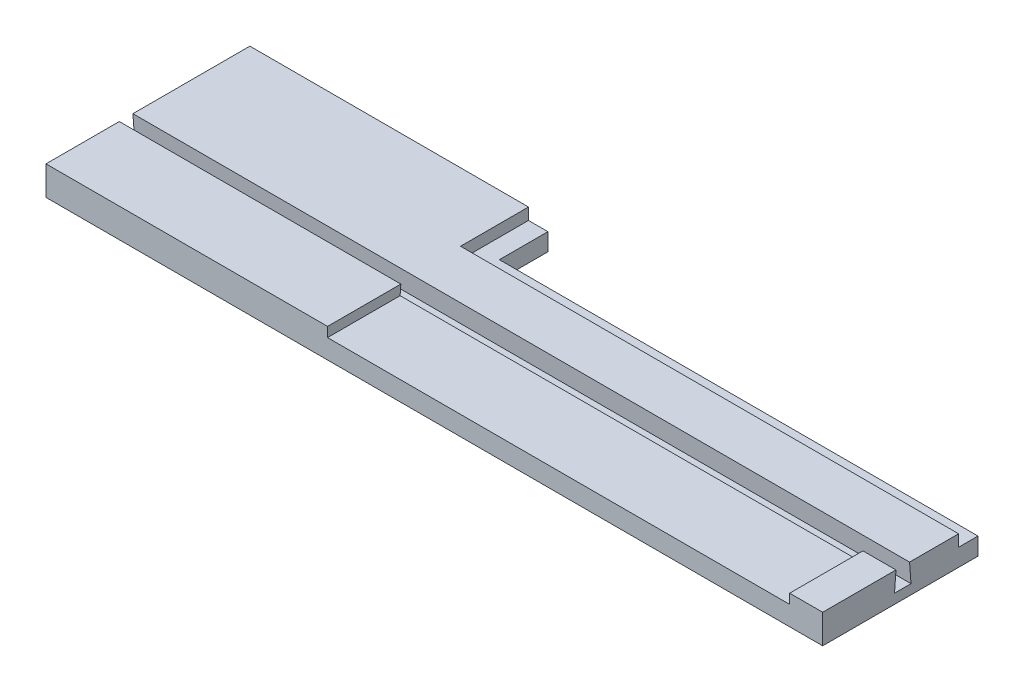
ISO-10303-21;
HEADER;
FILE_DESCRIPTION(('STEP AP214'),'2;1');
FILE_NAME('part.step','',(''),(''),'','','');
FILE_SCHEMA(('AUTOMOTIVE_DESIGN { 1 0 10303 214 1 1 1 1 }'));
ENDSEC;
DATA;
#1=APPLICATION_CONTEXT('core data for automotive mechanical design processes');
#2=APPLICATION_PROTOCOL_DEFINITION('international standard','automotive_design',2000,#1);
#3=PRODUCT_CONTEXT('',#1,'mechanical');
#4=PRODUCT('Part','Part','',(#3));
#5=PRODUCT_RELATED_PRODUCT_CATEGORY('part','',(#4));
#6=PRODUCT_DEFINITION_FORMATION('','',#4);
#7=PRODUCT_DEFINITION_CONTEXT('part definition',#1,'design');
#8=PRODUCT_DEFINITION('design','',#6,#7);
#9=PRODUCT_DEFINITION_SHAPE('','',#8);
#10=(LENGTH_UNIT() NAMED_UNIT(*) SI_UNIT(.MILLI.,.METRE.));
#11=(NAMED_UNIT(*) PLANE_ANGLE_UNIT() SI_UNIT($,.RADIAN.));
#12=(NAMED_UNIT(*) SI_UNIT($,.STERADIAN.) SOLID_ANGLE_UNIT());
#13=UNCERTAINTY_MEASURE_WITH_UNIT(LENGTH_MEASURE(1.E-05),#10,'distance_accuracy_value','');
#14=(GEOMETRIC_REPRESENTATION_CONTEXT(3) GLOBAL_UNCERTAINTY_ASSIGNED_CONTEXT((#13)) GLOBAL_UNIT_ASSIGNED_CONTEXT((#10,
#11,#12)) REPRESENTATION_CONTEXT('',''));
#15=CARTESIAN_POINT('',(0.,0.,0.));
#16=DIRECTION('',(0.,0.,1.));
#17=DIRECTION('',(1.,0.,0.));
#18=AXIS2_PLACEMENT_3D('',#15,#16,#17);
#19=CARTESIAN_POINT('',(0.,4.,0.));
#20=DIRECTION('',(0.,-1.,0.));
#21=DIRECTION('',(0.,0.,-1.));
#22=AXIS2_PLACEMENT_3D('',#19,#20,#21);
#23=PLANE('',#22);
#24=DIRECTION('',(-1.,0.,0.));
#25=VECTOR('',#24,1.);
#26=CARTESIAN_POINT('',(74.4601625665586,4.,-2.68636363636364));
#27=LINE('',#26,#25);
#28=CARTESIAN_POINT('',(72.4545454545455,4.,-2.68636363636364));
#29=VERTEX_POINT('',#28);
#30=CARTESIAN_POINT('',(69.0545454545454,4.,-2.68636363636364));
#31=VERTEX_POINT('',#30);
#32=EDGE_CURVE('E251',#29,#31,#27,.T.);
#33=ORIENTED_EDGE('',*,*,#32,.T.);
#34=DIRECTION('',(0.,0.,-1.));
#35=VECTOR('',#34,1.);
#36=CARTESIAN_POINT('',(69.0545454545454,4.,4.86363636363636));
#37=LINE('',#36,#35);
#38=CARTESIAN_POINT('',(69.0545454545454,4.,4.86363636363636));
#39=VERTEX_POINT('',#38);
#40=EDGE_CURVE('E185',#39,#31,#37,.T.);
#41=ORIENTED_EDGE('',*,*,#40,.F.);
#42=DIRECTION('',(1.,0.,0.));
#43=VECTOR('',#42,1.);
#44=CARTESIAN_POINT('',(-7.54545454545454,4.,4.86363636363636));
#45=LINE('',#44,#43);
#46=CARTESIAN_POINT('',(72.4545454545454,4.,4.86363636363636));
#47=VERTEX_POINT('',#46);
#48=EDGE_CURVE('E309',#39,#47,#45,.T.);
#49=ORIENTED_EDGE('',*,*,#48,.T.);
#50=DIRECTION('',(0.,0.,-1.));
#51=VECTOR('',#50,1.);
#52=CARTESIAN_POINT('',(72.4545454545454,4.,4.86363636363636));
#53=LINE('',#52,#51);
#54=EDGE_CURVE('E306',#47,#29,#53,.T.);
#55=ORIENTED_EDGE('',*,*,#54,.T.);
#56=EDGE_LOOP('',(#33,#41,#49,#55));
#57=FACE_BOUND('',#56,.T.);
#58=ADVANCED_FACE('F39',(#57),#23,.F.);
#59=CARTESIAN_POINT('',(-7.54545454545454,2.,-9.13636363636364));
#60=DIRECTION('',(0.,0.,1.));
#61=DIRECTION('',(1.,0.,0.));
#62=AXIS2_PLACEMENT_3D('',#59,#60,#61);
#63=PLANE('',#62);
#64=DIRECTION('',(-1.,0.,0.));
#65=VECTOR('',#64,1.);
#66=CARTESIAN_POINT('',(21.1545454545455,2.8,-9.13636363636364));
#67=LINE('',#66,#65);
#68=CARTESIAN_POINT('',(72.4545454545455,2.8,-9.13636363636364));
#69=VERTEX_POINT('',#68);
#70=CARTESIAN_POINT('',(21.1545454545455,2.8,-9.13636363636364));
#71=VERTEX_POINT('',#70);
#72=EDGE_CURVE('E213',#69,#71,#67,.T.);
#73=ORIENTED_EDGE('',*,*,#72,.T.);
#74=DIRECTION('',(0.,-1.,0.));
#75=VECTOR('',#74,1.);
#76=CARTESIAN_POINT('',(21.1545454545455,33.5413269844129,-9.13636363636364));
#77=LINE('',#76,#75);
#78=CARTESIAN_POINT('',(21.1545454545455,4.,-9.13636363636364));
#79=VERTEX_POINT('',#78);
#80=EDGE_CURVE('E274',#79,#71,#77,.T.);
#81=ORIENTED_EDGE('',*,*,#80,.F.);
#82=DIRECTION('',(1.,0.,0.));
#83=VECTOR('',#82,1.);
#84=CARTESIAN_POINT('',(-7.54545454545454,4.,-9.13636363636364));
#85=LINE('',#84,#83);
#86=CARTESIAN_POINT('',(72.4545454545455,4.,-9.13636363636364));
#87=VERTEX_POINT('',#86);
#88=EDGE_CURVE('E294',#79,#87,#85,.T.);
#89=ORIENTED_EDGE('',*,*,#88,.T.);
#90=DIRECTION('',(0.,-1.,0.));
#91=VECTOR('',#90,1.);
#92=CARTESIAN_POINT('',(72.4545454545455,2.,-9.13636363636364));
#93=LINE('',#92,#91);
#94=EDGE_CURVE('E322',#87,#69,#93,.T.);
#95=ORIENTED_EDGE('',*,*,#94,.T.);
#96=EDGE_LOOP('',(#73,#81,#89,#95));
#97=FACE_BOUND('',#96,.T.);
#98=ADVANCED_FACE('F372',(#97),#63,.F.);
#99=CARTESIAN_POINT('',(21.1545454545455,33.5413269844129,-9.13636363636364));
#100=DIRECTION('',(1.,0.,0.));
#101=DIRECTION('',(0.,0.,-1.));
#102=AXIS2_PLACEMENT_3D('',#99,#100,#101);
#103=PLANE('',#102);
#104=ORIENTED_EDGE('',*,*,#80,.T.);
#105=DIRECTION('',(0.,0.,-1.));
#106=VECTOR('',#105,1.);
#107=CARTESIAN_POINT('',(21.1545454545455,2.8,-9.13636363636364));
#108=LINE('',#107,#106);
#109=CARTESIAN_POINT('',(21.1545454545455,2.8,-16.1363636363636));
#110=VERTEX_POINT('',#109);
#111=EDGE_CURVE('E193',#71,#110,#108,.T.);
#112=ORIENTED_EDGE('',*,*,#111,.T.);
#113=DIRECTION('',(0.,-1.,0.));
#114=VECTOR('',#113,1.);
#115=CARTESIAN_POINT('',(21.1545454545455,33.5413269844129,-16.1363636363636));
#116=LINE('',#115,#114);
#117=CARTESIAN_POINT('',(21.1545454545455,4.,-16.1363636363636));
#118=VERTEX_POINT('',#117);
#119=EDGE_CURVE('E278',#118,#110,#116,.T.);
#120=ORIENTED_EDGE('',*,*,#119,.F.);
#121=DIRECTION('',(0.,0.,-1.));
#122=VECTOR('',#121,1.);
#123=CARTESIAN_POINT('',(21.1545454545455,4.,-9.13636363636364));
#124=LINE('',#123,#122);
#125=EDGE_CURVE('E270',#79,#118,#124,.T.);
#126=ORIENTED_EDGE('',*,*,#125,.F.);
#127=EDGE_LOOP('',(#104,#112,#120,#126));
#128=FACE_BOUND('',#127,.T.);
#129=ADVANCED_FACE('F377',(#128),#103,.T.);
#130=CARTESIAN_POINT('',(0.,2.,0.));
#131=DIRECTION('',(0.,1.,0.));
#132=DIRECTION('',(0.,0.,1.));
#133=AXIS2_PLACEMENT_3D('',#130,#131,#132);
#134=PLANE('',#133);
#135=DIRECTION('',(0.,0.,-1.));
#136=VECTOR('',#135,1.);
#137=CARTESIAN_POINT('',(72.4545454545455,2.,-9.13636363636364));
#138=LINE('',#137,#136);
#139=CARTESIAN_POINT('',(72.4545454545455,2.,-2.53636363636364));
#140=VERTEX_POINT('',#139);
#141=CARTESIAN_POINT('',(72.4545454545455,2.,-4.23636363636364));
#142=VERTEX_POINT('',#141);
#143=EDGE_CURVE('E318',#140,#142,#138,.T.);
#144=ORIENTED_EDGE('',*,*,#143,.T.);
#145=DIRECTION('',(1.,0.,0.));
#146=VECTOR('',#145,1.);
#147=CARTESIAN_POINT('',(-7.54545454545454,2.,-4.23636363636364));
#148=LINE('',#147,#146);
#149=CARTESIAN_POINT('',(-7.54545454545454,2.,-4.23636363636364));
#150=VERTEX_POINT('',#149);
#151=EDGE_CURVE('E289',#150,#142,#148,.T.);
#152=ORIENTED_EDGE('',*,*,#151,.F.);
#153=DIRECTION('',(0.,0.,1.));
#154=VECTOR('',#153,1.);
#155=CARTESIAN_POINT('',(-7.54545454545454,2.,-9.13636363636364));
#156=LINE('',#155,#154);
#157=CARTESIAN_POINT('',(-7.54545454545454,2.,-2.53636363636364));
#158=VERTEX_POINT('',#157);
#159=EDGE_CURVE('E313',#150,#158,#156,.T.);
#160=ORIENTED_EDGE('',*,*,#159,.T.);
#161=DIRECTION('',(1.,0.,0.));
#162=VECTOR('',#161,1.);
#163=CARTESIAN_POINT('',(-7.54545454545454,2.,-2.53636363636364));
#164=LINE('',#163,#162);
#165=EDGE_CURVE('E293',#158,#140,#164,.T.);
#166=ORIENTED_EDGE('',*,*,#165,.T.);
#167=EDGE_LOOP('',(#144,#152,#160,#166));
#168=FACE_BOUND('',#167,.T.);
#169=ADVANCED_FACE('F394',(#168),#134,.T.);
#170=CARTESIAN_POINT('',(-7.54545454545454,2.,-9.13636363636364));
#171=DIRECTION('',(1.,0.,0.));
#172=DIRECTION('',(0.,0.,-1.));
#173=AXIS2_PLACEMENT_3D('',#170,#171,#172);
#174=PLANE('',#173);
#175=DIRECTION('',(0.,-1.,0.));
#176=VECTOR('',#175,1.);
#177=CARTESIAN_POINT('',(-7.54545454545454,33.5413269844129,-16.1363636363636));
#178=LINE('',#177,#176);
#179=CARTESIAN_POINT('',(-7.54545454545454,4.,-16.1363636363636));
#180=VERTEX_POINT('',#179);
#181=CARTESIAN_POINT('',(-7.54545454545454,1.,-16.1363636363636));
#182=VERTEX_POINT('',#181);
#183=EDGE_CURVE('E262',#180,#182,#178,.T.);
#184=ORIENTED_EDGE('',*,*,#183,.T.);
#185=DIRECTION('',(0.,0.,-1.));
#186=VECTOR('',#185,1.);
#187=CARTESIAN_POINT('',(-7.54545454545454,1.,-16.1363636363636));
#188=LINE('',#187,#186);
#189=CARTESIAN_POINT('',(-7.54545454545454,1.,4.86363636363636));
#190=VERTEX_POINT('',#189);
#191=EDGE_CURVE('E62',#190,#182,#188,.T.);
#192=ORIENTED_EDGE('',*,*,#191,.F.);
#193=DIRECTION('',(0.,-1.,0.));
#194=VECTOR('',#193,1.);
#195=CARTESIAN_POINT('',(-7.54545454545454,2.,4.86363636363636));
#196=LINE('',#195,#194);
#197=CARTESIAN_POINT('',(-7.54545454545454,4.,4.86363636363636));
#198=VERTEX_POINT('',#197);
#199=EDGE_CURVE('E330',#198,#190,#196,.T.);
#200=ORIENTED_EDGE('',*,*,#199,.F.);
#201=DIRECTION('',(0.,0.,-1.));
#202=VECTOR('',#201,1.);
#203=CARTESIAN_POINT('',(-7.54545454545454,4.,4.86363636363636));
#204=LINE('',#203,#202);
#205=CARTESIAN_POINT('',(-7.54545454545454,4.,-2.68636363636364));
#206=VERTEX_POINT('',#205);
#207=EDGE_CURVE('E302',#198,#206,#204,.T.);
#208=ORIENTED_EDGE('',*,*,#207,.T.);
#209=DIRECTION('',(0.,-0.997199309888457,0.0747899482416342));
#210=VECTOR('',#209,1.);
#211=CARTESIAN_POINT('',(-7.54545454545454,2.,-2.53636363636364));
#212=LINE('',#211,#210);
#213=EDGE_CURVE('E245',#206,#158,#212,.T.);
#214=ORIENTED_EDGE('',*,*,#213,.T.);
#215=ORIENTED_EDGE('',*,*,#159,.F.);
#216=DIRECTION('',(0.,0.997199309888457,0.0747899482416342));
#217=VECTOR('',#216,1.);
#218=CARTESIAN_POINT('',(-7.54545454545454,4.,-4.08636363636364));
#219=LINE('',#218,#217);
#220=CARTESIAN_POINT('',(-7.54545454545454,4.,-4.08636363636364));
#221=VERTEX_POINT('',#220);
#222=EDGE_CURVE('E250',#150,#221,#219,.T.);
#223=ORIENTED_EDGE('',*,*,#222,.T.);
#224=DIRECTION('',(0.,0.,1.));
#225=VECTOR('',#224,1.);
#226=CARTESIAN_POINT('',(-7.54545454545454,4.,-9.13636363636364));
#227=LINE('',#226,#225);
#228=EDGE_CURVE('E288',#180,#221,#227,.T.);
#229=ORIENTED_EDGE('',*,*,#228,.F.);
#230=EDGE_LOOP('',(#184,#192,#200,#208,#214,#215,#223,#229));
#231=FACE_BOUND('',#230,.T.);
#232=ADVANCED_FACE('F41',(#231),#174,.F.);
#233=CARTESIAN_POINT('',(-7.54545454545454,2.,4.86363636363636));
#234=DIRECTION('',(0.,0.,-1.));
#235=DIRECTION('',(-1.,0.,0.));
#236=AXIS2_PLACEMENT_3D('',#233,#234,#235);
#237=PLANE('',#236);
#238=ORIENTED_EDGE('',*,*,#48,.F.);
#239=DIRECTION('',(0.,1.,0.));
#240=VECTOR('',#239,1.);
#241=CARTESIAN_POINT('',(69.0545454545454,3.,4.86363636363636));
#242=LINE('',#241,#240);
#243=CARTESIAN_POINT('',(69.0545454545454,3.,4.86363636363636));
#244=VERTEX_POINT('',#243);
#245=EDGE_CURVE('E177',#244,#39,#242,.T.);
#246=ORIENTED_EDGE('',*,*,#245,.F.);
#247=DIRECTION('',(1.,0.,0.));
#248=VECTOR('',#247,1.);
#249=CARTESIAN_POINT('',(69.0545454545454,3.,4.86363636363636));
#250=LINE('',#249,#248);
#251=CARTESIAN_POINT('',(21.4545454545455,3.,4.86363636363637));
#252=VERTEX_POINT('',#251);
#253=EDGE_CURVE('E160',#252,#244,#250,.T.);
#254=ORIENTED_EDGE('',*,*,#253,.F.);
#255=DIRECTION('',(0.,1.,0.));
#256=VECTOR('',#255,1.);
#257=CARTESIAN_POINT('',(21.4545454545455,3.,4.86363636363637));
#258=LINE('',#257,#256);
#259=CARTESIAN_POINT('',(21.4545454545455,4.,4.86363636363637));
#260=VERTEX_POINT('',#259);
#261=EDGE_CURVE('E169',#252,#260,#258,.T.);
#262=ORIENTED_EDGE('',*,*,#261,.T.);
#263=EDGE_CURVE('E310',#198,#260,#45,.T.);
#264=ORIENTED_EDGE('',*,*,#263,.F.);
#265=ORIENTED_EDGE('',*,*,#199,.T.);
#266=DIRECTION('',(-1.,0.,0.));
#267=VECTOR('',#266,1.);
#268=CARTESIAN_POINT('',(-7.54545454545454,1.,4.86363636363636));
#269=LINE('',#268,#267);
#270=CARTESIAN_POINT('',(72.4545454545454,1.,4.86363636363636));
#271=VERTEX_POINT('',#270);
#272=EDGE_CURVE('E242',#271,#190,#269,.T.);
#273=ORIENTED_EDGE('',*,*,#272,.F.);
#274=DIRECTION('',(0.,-1.,0.));
#275=VECTOR('',#274,1.);
#276=CARTESIAN_POINT('',(72.4545454545454,2.,4.86363636363636));
#277=LINE('',#276,#275);
#278=EDGE_CURVE('E326',#47,#271,#277,.T.);
#279=ORIENTED_EDGE('',*,*,#278,.F.);
#280=EDGE_LOOP('',(#238,#246,#254,#262,#264,#265,#273,#279));
#281=FACE_BOUND('',#280,.T.);
#282=ADVANCED_FACE('F180',(#281),#237,.F.);
#283=CARTESIAN_POINT('',(72.4545454545455,2.,-9.13636363636364));
#284=DIRECTION('',(-1.,0.,0.));
#285=DIRECTION('',(0.,0.,1.));
#286=AXIS2_PLACEMENT_3D('',#283,#284,#285);
#287=PLANE('',#286);
#288=ORIENTED_EDGE('',*,*,#278,.T.);
#289=DIRECTION('',(0.,0.,1.));
#290=VECTOR('',#289,1.);
#291=CARTESIAN_POINT('',(72.4545454545454,1.,4.86363636363636));
#292=LINE('',#291,#290);
#293=CARTESIAN_POINT('',(72.4545454545454,1.,-11.1363636363636));
#294=VERTEX_POINT('',#293);
#295=EDGE_CURVE('E239',#294,#271,#292,.T.);
#296=ORIENTED_EDGE('',*,*,#295,.F.);
#297=DIRECTION('',(0.,-1.,0.));
#298=VECTOR('',#297,1.);
#299=CARTESIAN_POINT('',(72.4545454545454,2.8,-11.1363636363636));
#300=LINE('',#299,#298);
#301=CARTESIAN_POINT('',(72.4545454545454,2.8,-11.1363636363636));
#302=VERTEX_POINT('',#301);
#303=EDGE_CURVE('E224',#302,#294,#300,.T.);
#304=ORIENTED_EDGE('',*,*,#303,.F.);
#305=DIRECTION('',(0.,0.,1.));
#306=VECTOR('',#305,1.);
#307=CARTESIAN_POINT('',(72.4545454545455,2.8,-9.13636363636364));
#308=LINE('',#307,#306);
#309=EDGE_CURVE('E210',#302,#69,#308,.T.);
#310=ORIENTED_EDGE('',*,*,#309,.T.);
#311=ORIENTED_EDGE('',*,*,#94,.F.);
#312=DIRECTION('',(0.,0.,1.));
#313=VECTOR('',#312,1.);
#314=CARTESIAN_POINT('',(72.4545454545455,4.,-9.13636363636364));
#315=LINE('',#314,#313);
#316=CARTESIAN_POINT('',(72.4545454545455,4.,-4.08636363636364));
#317=VERTEX_POINT('',#316);
#318=EDGE_CURVE('E297',#87,#317,#315,.T.);
#319=ORIENTED_EDGE('',*,*,#318,.T.);
#320=DIRECTION('',(0.,-0.997199309888457,-0.0747899482416342));
#321=VECTOR('',#320,1.);
#322=CARTESIAN_POINT('',(72.4545454545455,4.,-4.08636363636364));
#323=LINE('',#322,#321);
#324=EDGE_CURVE('E259',#317,#142,#323,.T.);
#325=ORIENTED_EDGE('',*,*,#324,.T.);
#326=ORIENTED_EDGE('',*,*,#143,.F.);
#327=DIRECTION('',(0.,0.997199309888457,-0.0747899482416342));
#328=VECTOR('',#327,1.);
#329=CARTESIAN_POINT('',(72.4545454545455,2.,-2.53636363636364));
#330=LINE('',#329,#328);
#331=EDGE_CURVE('E246',#140,#29,#330,.T.);
#332=ORIENTED_EDGE('',*,*,#331,.T.);
#333=ORIENTED_EDGE('',*,*,#54,.F.);
#334=EDGE_LOOP('',(#288,#296,#304,#310,#311,#319,#325,#326,#332,#333));
#335=FACE_BOUND('',#334,.T.);
#336=ADVANCED_FACE('F353',(#335),#287,.F.);
#337=ORIENTED_EDGE('',*,*,#263,.T.);
#338=DIRECTION('',(0.,0.,1.));
#339=VECTOR('',#338,1.);
#340=CARTESIAN_POINT('',(21.4545454545455,4.,4.86363636363637));
#341=LINE('',#340,#339);
#342=CARTESIAN_POINT('',(21.4545454545455,4.,-2.68636363636364));
#343=VERTEX_POINT('',#342);
#344=EDGE_CURVE('E172',#343,#260,#341,.T.);
#345=ORIENTED_EDGE('',*,*,#344,.F.);
#346=EDGE_CURVE('E255',#343,#206,#27,.T.);
#347=ORIENTED_EDGE('',*,*,#346,.T.);
#348=ORIENTED_EDGE('',*,*,#207,.F.);
#349=EDGE_LOOP('',(#337,#345,#347,#348));
#350=FACE_BOUND('',#349,.T.);
#351=ADVANCED_FACE('F339',(#350),#23,.F.);
#352=CARTESIAN_POINT('',(0.,4.,0.));
#353=DIRECTION('',(0.,-1.,0.));
#354=DIRECTION('',(0.,0.,-1.));
#355=AXIS2_PLACEMENT_3D('',#352,#353,#354);
#356=PLANE('',#355);
#357=ORIENTED_EDGE('',*,*,#88,.F.);
#358=ORIENTED_EDGE('',*,*,#125,.T.);
#359=DIRECTION('',(-1.,0.,0.));
#360=VECTOR('',#359,1.);
#361=CARTESIAN_POINT('',(-7.54545454545454,4.,-16.1363636363636));
#362=LINE('',#361,#360);
#363=EDGE_CURVE('E273',#118,#180,#362,.T.);
#364=ORIENTED_EDGE('',*,*,#363,.T.);
#365=ORIENTED_EDGE('',*,*,#228,.T.);
#366=DIRECTION('',(-1.,0.,0.));
#367=VECTOR('',#366,1.);
#368=CARTESIAN_POINT('',(74.4601625665586,4.,-4.08636363636364));
#369=LINE('',#368,#367);
#370=EDGE_CURVE('E263',#317,#221,#369,.T.);
#371=ORIENTED_EDGE('',*,*,#370,.F.);
#372=ORIENTED_EDGE('',*,*,#318,.F.);
#373=EDGE_LOOP('',(#357,#358,#364,#365,#371,#372));
#374=FACE_BOUND('',#373,.T.);
#375=ADVANCED_FACE('F383',(#374),#356,.F.);
#376=CARTESIAN_POINT('',(-7.54545454545454,33.5413269844129,-16.1363636363636));
#377=DIRECTION('',(0.,0.,-1.));
#378=DIRECTION('',(-1.,0.,0.));
#379=AXIS2_PLACEMENT_3D('',#376,#377,#378);
#380=PLANE('',#379);
#381=DIRECTION('',(1.,0.,0.));
#382=VECTOR('',#381,1.);
#383=CARTESIAN_POINT('',(21.1545454545455,1.,-16.1363636363636));
#384=LINE('',#383,#382);
#385=CARTESIAN_POINT('',(23.1545454545455,1.,-16.1363636363636));
#386=VERTEX_POINT('',#385);
#387=EDGE_CURVE('E236',#182,#386,#384,.T.);
#388=ORIENTED_EDGE('',*,*,#387,.F.);
#389=ORIENTED_EDGE('',*,*,#183,.F.);
#390=ORIENTED_EDGE('',*,*,#363,.F.);
#391=ORIENTED_EDGE('',*,*,#119,.T.);
#392=DIRECTION('',(1.,0.,0.));
#393=VECTOR('',#392,1.);
#394=CARTESIAN_POINT('',(21.1545454545455,2.8,-16.1363636363636));
#395=LINE('',#394,#393);
#396=CARTESIAN_POINT('',(23.1545454545455,2.8,-16.1363636363636));
#397=VERTEX_POINT('',#396);
#398=EDGE_CURVE('E197',#110,#397,#395,.T.);
#399=ORIENTED_EDGE('',*,*,#398,.T.);
#400=DIRECTION('',(0.,-1.,0.));
#401=VECTOR('',#400,1.);
#402=CARTESIAN_POINT('',(23.1545454545455,2.8,-16.1363636363636));
#403=LINE('',#402,#401);
#404=EDGE_CURVE('E217',#397,#386,#403,.T.);
#405=ORIENTED_EDGE('',*,*,#404,.T.);
#406=EDGE_LOOP('',(#388,#389,#390,#391,#399,#405));
#407=FACE_BOUND('',#406,.T.);
#408=ADVANCED_FACE('F388',(#407),#380,.T.);
#409=CARTESIAN_POINT('',(74.4601625665586,4.,-4.08636363636364));
#410=DIRECTION('',(0.,-0.0747899482416342,0.997199309888456));
#411=DIRECTION('',(0.,-0.997199309888457,-0.0747899482416342));
#412=AXIS2_PLACEMENT_3D('',#409,#410,#411);
#413=PLANE('',#412);
#414=ORIENTED_EDGE('',*,*,#324,.F.);
#415=ORIENTED_EDGE('',*,*,#370,.T.);
#416=ORIENTED_EDGE('',*,*,#222,.F.);
#417=ORIENTED_EDGE('',*,*,#151,.T.);
#418=EDGE_LOOP('',(#414,#415,#416,#417));
#419=FACE_BOUND('',#418,.T.);
#420=ADVANCED_FACE('F426',(#419),#413,.T.);
#421=CARTESIAN_POINT('',(74.4601625665586,2.,-2.53636363636364));
#422=DIRECTION('',(0.,-0.0747899482416342,-0.997199309888456));
#423=DIRECTION('',(0.,0.997199309888457,-0.0747899482416342));
#424=AXIS2_PLACEMENT_3D('',#421,#422,#423);
#425=PLANE('',#424);
#426=DIRECTION('',(0.,-0.997199309888457,0.0747899482416342));
#427=VECTOR('',#426,1.);
#428=CARTESIAN_POINT('',(69.0545454545454,2.,-2.53636363636364));
#429=LINE('',#428,#427);
#430=CARTESIAN_POINT('',(69.0545454545454,3.,-2.61136363636364));
#431=VERTEX_POINT('',#430);
#432=EDGE_CURVE('E11',#31,#431,#429,.T.);
#433=ORIENTED_EDGE('',*,*,#432,.F.);
#434=ORIENTED_EDGE('',*,*,#32,.F.);
#435=ORIENTED_EDGE('',*,*,#331,.F.);
#436=ORIENTED_EDGE('',*,*,#165,.F.);
#437=ORIENTED_EDGE('',*,*,#213,.F.);
#438=ORIENTED_EDGE('',*,*,#346,.F.);
#439=DIRECTION('',(0.,0.997199309888457,-0.0747899482416342));
#440=VECTOR('',#439,1.);
#441=CARTESIAN_POINT('',(21.4545454545455,2.,-2.53636363636364));
#442=LINE('',#441,#440);
#443=CARTESIAN_POINT('',(21.4545454545455,3.,-2.61136363636364));
#444=VERTEX_POINT('',#443);
#445=EDGE_CURVE('E48',#444,#343,#442,.T.);
#446=ORIENTED_EDGE('',*,*,#445,.F.);
#447=DIRECTION('',(1.,0.,0.));
#448=VECTOR('',#447,1.);
#449=CARTESIAN_POINT('',(74.4601625665586,3.,-2.61136363636364));
#450=LINE('',#449,#448);
#451=EDGE_CURVE('E163',#444,#431,#450,.T.);
#452=ORIENTED_EDGE('',*,*,#451,.T.);
#453=EDGE_LOOP('',(#433,#434,#435,#436,#437,#438,#446,#452));
#454=FACE_BOUND('',#453,.T.);
#455=ADVANCED_FACE('F343',(#454),#425,.T.);
#456=CARTESIAN_POINT('',(0.,1.,0.));
#457=DIRECTION('',(0.,1.,0.));
#458=DIRECTION('',(0.,0.,1.));
#459=AXIS2_PLACEMENT_3D('',#456,#457,#458);
#460=PLANE('',#459);
#461=DIRECTION('',(1.,0.,0.));
#462=VECTOR('',#461,1.);
#463=CARTESIAN_POINT('',(23.1545454545455,1.,-11.1363636363636));
#464=LINE('',#463,#462);
#465=CARTESIAN_POINT('',(23.1545454545455,1.,-11.1363636363636));
#466=VERTEX_POINT('',#465);
#467=EDGE_CURVE('E198',#466,#294,#464,.T.);
#468=ORIENTED_EDGE('',*,*,#467,.T.);
#469=ORIENTED_EDGE('',*,*,#295,.T.);
#470=ORIENTED_EDGE('',*,*,#272,.T.);
#471=ORIENTED_EDGE('',*,*,#191,.T.);
#472=ORIENTED_EDGE('',*,*,#387,.T.);
#473=DIRECTION('',(0.,0.,1.));
#474=VECTOR('',#473,1.);
#475=CARTESIAN_POINT('',(23.1545454545455,1.,-16.1363636363636));
#476=LINE('',#475,#474);
#477=EDGE_CURVE('E191',#386,#466,#476,.T.);
#478=ORIENTED_EDGE('',*,*,#477,.T.);
#479=EDGE_LOOP('',(#468,#469,#470,#471,#472,#478));
#480=FACE_BOUND('',#479,.T.);
#481=ADVANCED_FACE('F410',(#480),#460,.F.);
#482=CARTESIAN_POINT('',(23.1545454545455,2.8,-11.1363636363636));
#483=DIRECTION('',(0.,0.,-1.));
#484=DIRECTION('',(-1.,0.,0.));
#485=AXIS2_PLACEMENT_3D('',#482,#483,#484);
#486=PLANE('',#485);
#487=ORIENTED_EDGE('',*,*,#467,.F.);
#488=DIRECTION('',(0.,-1.,0.));
#489=VECTOR('',#488,1.);
#490=CARTESIAN_POINT('',(23.1545454545455,2.8,-11.1363636363636));
#491=LINE('',#490,#489);
#492=CARTESIAN_POINT('',(23.1545454545455,2.8,-11.1363636363636));
#493=VERTEX_POINT('',#492);
#494=EDGE_CURVE('E228',#493,#466,#491,.T.);
#495=ORIENTED_EDGE('',*,*,#494,.F.);
#496=DIRECTION('',(1.,0.,0.));
#497=VECTOR('',#496,1.);
#498=CARTESIAN_POINT('',(23.1545454545455,2.8,-11.1363636363636));
#499=LINE('',#498,#497);
#500=EDGE_CURVE('E206',#493,#302,#499,.T.);
#501=ORIENTED_EDGE('',*,*,#500,.T.);
#502=ORIENTED_EDGE('',*,*,#303,.T.);
#503=EDGE_LOOP('',(#487,#495,#501,#502));
#504=FACE_BOUND('',#503,.T.);
#505=ADVANCED_FACE('F416',(#504),#486,.T.);
#506=CARTESIAN_POINT('',(23.1545454545455,2.8,-16.1363636363636));
#507=DIRECTION('',(1.,0.,0.));
#508=DIRECTION('',(0.,0.,-1.));
#509=AXIS2_PLACEMENT_3D('',#506,#507,#508);
#510=PLANE('',#509);
#511=ORIENTED_EDGE('',*,*,#477,.F.);
#512=ORIENTED_EDGE('',*,*,#404,.F.);
#513=DIRECTION('',(0.,0.,1.));
#514=VECTOR('',#513,1.);
#515=CARTESIAN_POINT('',(23.1545454545455,2.8,-16.1363636363636));
#516=LINE('',#515,#514);
#517=EDGE_CURVE('E202',#397,#493,#516,.T.);
#518=ORIENTED_EDGE('',*,*,#517,.T.);
#519=ORIENTED_EDGE('',*,*,#494,.T.);
#520=EDGE_LOOP('',(#511,#512,#518,#519));
#521=FACE_BOUND('',#520,.T.);
#522=ADVANCED_FACE('F368',(#521),#510,.T.);
#523=CARTESIAN_POINT('',(0.,2.8,0.));
#524=DIRECTION('',(0.,-1.,0.));
#525=DIRECTION('',(0.,0.,-1.));
#526=AXIS2_PLACEMENT_3D('',#523,#524,#525);
#527=PLANE('',#526);
#528=ORIENTED_EDGE('',*,*,#111,.F.);
#529=ORIENTED_EDGE('',*,*,#72,.F.);
#530=ORIENTED_EDGE('',*,*,#309,.F.);
#531=ORIENTED_EDGE('',*,*,#500,.F.);
#532=ORIENTED_EDGE('',*,*,#517,.F.);
#533=ORIENTED_EDGE('',*,*,#398,.F.);
#534=EDGE_LOOP('',(#528,#529,#530,#531,#532,#533));
#535=FACE_BOUND('',#534,.T.);
#536=ADVANCED_FACE('F361',(#535),#527,.F.);
#537=CARTESIAN_POINT('',(69.0545454545454,3.,4.86363636363636));
#538=DIRECTION('',(1.,0.,0.));
#539=DIRECTION('',(0.,0.,-1.));
#540=AXIS2_PLACEMENT_3D('',#537,#538,#539);
#541=PLANE('',#540);
#542=ORIENTED_EDGE('',*,*,#432,.T.);
#543=DIRECTION('',(0.,0.,-1.));
#544=VECTOR('',#543,1.);
#545=CARTESIAN_POINT('',(69.0545454545454,3.,4.86363636363636));
#546=LINE('',#545,#544);
#547=EDGE_CURVE('E55',#244,#431,#546,.T.);
#548=ORIENTED_EDGE('',*,*,#547,.F.);
#549=ORIENTED_EDGE('',*,*,#245,.T.);
#550=ORIENTED_EDGE('',*,*,#40,.T.);
#551=EDGE_LOOP('',(#542,#548,#549,#550));
#552=FACE_BOUND('',#551,.T.);
#553=ADVANCED_FACE('F358',(#552),#541,.F.);
#554=CARTESIAN_POINT('',(21.4545454545455,3.,4.86363636363637));
#555=DIRECTION('',(-1.,0.,0.));
#556=DIRECTION('',(0.,0.,1.));
#557=AXIS2_PLACEMENT_3D('',#554,#555,#556);
#558=PLANE('',#557);
#559=ORIENTED_EDGE('',*,*,#445,.T.);
#560=ORIENTED_EDGE('',*,*,#344,.T.);
#561=ORIENTED_EDGE('',*,*,#261,.F.);
#562=DIRECTION('',(0.,0.,1.));
#563=VECTOR('',#562,1.);
#564=CARTESIAN_POINT('',(21.4545454545455,3.,4.86363636363637));
#565=LINE('',#564,#563);
#566=EDGE_CURVE('E156',#444,#252,#565,.T.);
#567=ORIENTED_EDGE('',*,*,#566,.F.);
#568=EDGE_LOOP('',(#559,#560,#561,#567));
#569=FACE_BOUND('',#568,.T.);
#570=ADVANCED_FACE('F170',(#569),#558,.F.);
#571=CARTESIAN_POINT('',(0.,3.,0.));
#572=DIRECTION('',(0.,1.,0.));
#573=DIRECTION('',(0.,0.,1.));
#574=AXIS2_PLACEMENT_3D('',#571,#572,#573);
#575=PLANE('',#574);
#576=ORIENTED_EDGE('',*,*,#566,.T.);
#577=ORIENTED_EDGE('',*,*,#253,.T.);
#578=ORIENTED_EDGE('',*,*,#547,.T.);
#579=ORIENTED_EDGE('',*,*,#451,.F.);
#580=EDGE_LOOP('',(#576,#577,#578,#579));
#581=FACE_BOUND('',#580,.T.);
#582=ADVANCED_FACE('F158',(#581),#575,.T.);
#583=CLOSED_SHELL('',(#58,#98,#129,#169,#232,#282,#336,#351,#375,#408,#420,#455,#481,#505,#522,
#536,#553,#570,#582));
#584=MANIFOLD_SOLID_BREP('B2',#583);
#585=ADVANCED_BREP_SHAPE_REPRESENTATION('',(#18,#584),#14);
#586=SHAPE_DEFINITION_REPRESENTATION(#9,#585);
ENDSEC;
END-ISO-10303-21;
